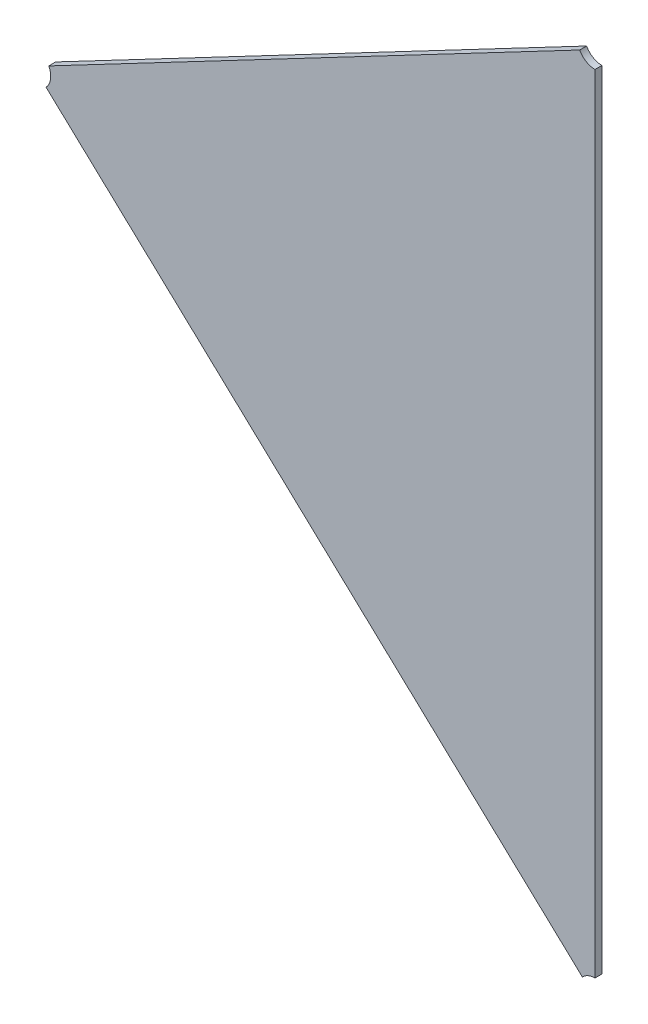
ISO-10303-21;
HEADER;
FILE_DESCRIPTION(('STEP AP214'),'2;1');
FILE_NAME('part.step','',(''),(''),'','','');
FILE_SCHEMA(('AUTOMOTIVE_DESIGN { 1 0 10303 214 1 1 1 1 }'));
ENDSEC;
DATA;
#1=APPLICATION_CONTEXT('core data for automotive mechanical design processes');
#2=APPLICATION_PROTOCOL_DEFINITION('international standard','automotive_design',2000,#1);
#3=PRODUCT_CONTEXT('',#1,'mechanical');
#4=PRODUCT('Part','Part','',(#3));
#5=PRODUCT_RELATED_PRODUCT_CATEGORY('part','',(#4));
#6=PRODUCT_DEFINITION_FORMATION('','',#4);
#7=PRODUCT_DEFINITION_CONTEXT('part definition',#1,'design');
#8=PRODUCT_DEFINITION('design','',#6,#7);
#9=PRODUCT_DEFINITION_SHAPE('','',#8);
#10=(LENGTH_UNIT() NAMED_UNIT(*) SI_UNIT(.MILLI.,.METRE.));
#11=(NAMED_UNIT(*) PLANE_ANGLE_UNIT() SI_UNIT($,.RADIAN.));
#12=(NAMED_UNIT(*) SI_UNIT($,.STERADIAN.) SOLID_ANGLE_UNIT());
#13=UNCERTAINTY_MEASURE_WITH_UNIT(LENGTH_MEASURE(1.E-05),#10,'distance_accuracy_value','');
#14=(GEOMETRIC_REPRESENTATION_CONTEXT(3) GLOBAL_UNCERTAINTY_ASSIGNED_CONTEXT((#13)) GLOBAL_UNIT_ASSIGNED_CONTEXT((#10,
#11,#12)) REPRESENTATION_CONTEXT('',''));
#15=CARTESIAN_POINT('',(0.,0.,0.));
#16=DIRECTION('',(0.,0.,1.));
#17=DIRECTION('',(1.,0.,0.));
#18=AXIS2_PLACEMENT_3D('',#15,#16,#17);
#19=CARTESIAN_POINT('',(-1.42761736866515,-0.918561701377886,0.));
#20=DIRECTION('',(0.,0.,1.));
#21=DIRECTION('',(1.,0.,0.));
#22=AXIS2_PLACEMENT_3D('',#19,#20,#21);
#23=PLANE('',#22);
#24=CARTESIAN_POINT('',(-1.37630287528467,-0.806521766430921,0.));
#25=DIRECTION('',(0.,0.,1.));
#26=DIRECTION('',(-0.885039467737435,-0.465515993868136,0.));
#27=AXIS2_PLACEMENT_3D('',#24,#25,#26);
#28=CIRCLE('',#27,0.00500000000000005);
#29=CARTESIAN_POINT('',(-1.38072807262335,-0.808849346400258,0.));
#30=VERTEX_POINT('',#29);
#31=CARTESIAN_POINT('',(-1.37630287528467,-0.811521766430921,0.));
#32=VERTEX_POINT('',#31);
#33=EDGE_CURVE('E11',#30,#32,#28,.T.);
#34=ORIENTED_EDGE('',*,*,#33,.T.);
#35=DIRECTION('',(0.,1.,0.));
#36=VECTOR('',#35,1.);
#37=CARTESIAN_POINT('',(-1.37630287528467,-1.03946386523316,0.));
#38=LINE('',#37,#36);
#39=CARTESIAN_POINT('',(-1.37630287528467,-1.03946386523316,0.));
#40=VERTEX_POINT('',#39);
#41=EDGE_CURVE('E116',#40,#32,#38,.T.);
#42=ORIENTED_EDGE('',*,*,#41,.F.);
#43=CARTESIAN_POINT('',(-1.37630287528467,-1.04446386523316,0.));
#44=DIRECTION('',(0.,0.,1.));
#45=DIRECTION('',(0.,1.,0.));
#46=AXIS2_PLACEMENT_3D('',#43,#44,#45);
#47=CIRCLE('',#46,0.00500000000000005);
#48=CARTESIAN_POINT('',(-1.37995198451857,-1.04104567831624,0.));
#49=VERTEX_POINT('',#48);
#50=EDGE_CURVE('E90',#40,#49,#47,.T.);
#51=ORIENTED_EDGE('',*,*,#50,.T.);
#52=DIRECTION('',(0.72982184678132,-0.683637383384425,0.));
#53=VECTOR('',#52,1.);
#54=CARTESIAN_POINT('',(-1.53532680727802,-0.895503258966166,0.));
#55=LINE('',#54,#53);
#56=CARTESIAN_POINT('',(-1.53532680727802,-0.895503258966164,0.));
#57=VERTEX_POINT('',#56);
#58=EDGE_CURVE('E103',#57,#49,#55,.T.);
#59=ORIENTED_EDGE('',*,*,#58,.F.);
#60=CARTESIAN_POINT('',(-1.53897591651193,-0.892085072049242,0.));
#61=DIRECTION('',(0.,0.,1.));
#62=DIRECTION('',(0.729821846781668,-0.683637383384054,0.));
#63=AXIS2_PLACEMENT_3D('',#60,#61,#62);
#64=CIRCLE('',#63,0.00500000000000004);
#65=CARTESIAN_POINT('',(-1.53455071917324,-0.889757492079906,0.));
#66=VERTEX_POINT('',#65);
#67=EDGE_CURVE('E77',#57,#66,#64,.T.);
#68=ORIENTED_EDGE('',*,*,#67,.T.);
#69=DIRECTION('',(-0.885039467737862,-0.465515993867324,0.));
#70=VECTOR('',#69,1.);
#71=CARTESIAN_POINT('',(-1.38072807262335,-0.808849346400254,0.));
#72=LINE('',#71,#70);
#73=EDGE_CURVE('E112',#30,#66,#72,.T.);
#74=ORIENTED_EDGE('',*,*,#73,.F.);
#75=EDGE_LOOP('',(#34,#42,#51,#59,#68,#74));
#76=FACE_BOUND('',#75,.T.);
#77=ADVANCED_FACE('F17',(#76),#23,.F.);
#78=CARTESIAN_POINT('',(-1.37630287528467,-0.806521766430921,0.));
#79=DIRECTION('',(-0.465515993867324,0.885039467737862,0.));
#80=DIRECTION('',(-0.885039467737862,-0.465515993867324,0.));
#81=AXIS2_PLACEMENT_3D('',#78,#79,#80);
#82=PLANE('',#81);
#83=DIRECTION('',(0.,0.,-1.));
#84=VECTOR('',#83,1.);
#85=CARTESIAN_POINT('',(-1.38072807262335,-0.808849346400258,0.002));
#86=LINE('',#85,#84);
#87=CARTESIAN_POINT('',(-1.38072807262335,-0.808849346400258,0.002));
#88=VERTEX_POINT('',#87);
#89=EDGE_CURVE('E24',#88,#30,#86,.T.);
#90=ORIENTED_EDGE('',*,*,#89,.T.);
#91=ORIENTED_EDGE('',*,*,#73,.T.);
#92=DIRECTION('',(0.,0.,1.));
#93=VECTOR('',#92,1.);
#94=CARTESIAN_POINT('',(-1.53455071917324,-0.889757492079906,0.));
#95=LINE('',#94,#93);
#96=CARTESIAN_POINT('',(-1.53455071917324,-0.889757492079906,0.002));
#97=VERTEX_POINT('',#96);
#98=EDGE_CURVE('E106',#66,#97,#95,.T.);
#99=ORIENTED_EDGE('',*,*,#98,.T.);
#100=DIRECTION('',(-0.885039467737862,-0.465515993867324,0.));
#101=VECTOR('',#100,1.);
#102=CARTESIAN_POINT('',(-1.38072807262335,-0.808849346400254,0.002));
#103=LINE('',#102,#101);
#104=EDGE_CURVE('E99',#88,#97,#103,.T.);
#105=ORIENTED_EDGE('',*,*,#104,.F.);
#106=EDGE_LOOP('',(#90,#91,#99,#105));
#107=FACE_BOUND('',#106,.T.);
#108=ADVANCED_FACE('F120',(#107),#82,.T.);
#109=CARTESIAN_POINT('',(-1.53897591651193,-0.892085072049242,0.));
#110=DIRECTION('',(-0.683637383384425,-0.729821846781321,0.));
#111=DIRECTION('',(0.729821846781321,-0.683637383384425,0.));
#112=AXIS2_PLACEMENT_3D('',#109,#110,#111);
#113=PLANE('',#112);
#114=DIRECTION('',(0.,0.,1.));
#115=VECTOR('',#114,1.);
#116=CARTESIAN_POINT('',(-1.37995198451857,-1.04104567831624,0.));
#117=LINE('',#116,#115);
#118=CARTESIAN_POINT('',(-1.37995198451857,-1.04104567831624,0.002));
#119=VERTEX_POINT('',#118);
#120=EDGE_CURVE('E114',#49,#119,#117,.T.);
#121=ORIENTED_EDGE('',*,*,#120,.T.);
#122=DIRECTION('',(0.72982184678132,-0.683637383384425,0.));
#123=VECTOR('',#122,1.);
#124=CARTESIAN_POINT('',(-1.53532680727802,-0.895503258966166,0.002));
#125=LINE('',#124,#123);
#126=CARTESIAN_POINT('',(-1.53532680727802,-0.895503258966164,0.002));
#127=VERTEX_POINT('',#126);
#128=EDGE_CURVE('E85',#127,#119,#125,.T.);
#129=ORIENTED_EDGE('',*,*,#128,.F.);
#130=DIRECTION('',(0.,0.,-1.));
#131=VECTOR('',#130,1.);
#132=CARTESIAN_POINT('',(-1.53532680727802,-0.895503258966164,0.002));
#133=LINE('',#132,#131);
#134=EDGE_CURVE('E96',#127,#57,#133,.T.);
#135=ORIENTED_EDGE('',*,*,#134,.T.);
#136=ORIENTED_EDGE('',*,*,#58,.T.);
#137=EDGE_LOOP('',(#121,#129,#135,#136));
#138=FACE_BOUND('',#137,.T.);
#139=ADVANCED_FACE('F127',(#138),#113,.T.);
#140=CARTESIAN_POINT('',(-1.42761736866515,-0.918561701377886,0.002));
#141=DIRECTION('',(0.,0.,1.));
#142=DIRECTION('',(1.,0.,0.));
#143=AXIS2_PLACEMENT_3D('',#140,#141,#142);
#144=PLANE('',#143);
#145=CARTESIAN_POINT('',(-1.37630287528467,-0.806521766430921,0.002));
#146=DIRECTION('',(0.,0.,-1.));
#147=DIRECTION('',(0.,-1.,0.));
#148=AXIS2_PLACEMENT_3D('',#145,#146,#147);
#149=CIRCLE('',#148,0.00500000000000005);
#150=CARTESIAN_POINT('',(-1.37630287528467,-0.811521766430921,0.002));
#151=VERTEX_POINT('',#150);
#152=EDGE_CURVE('E109',#151,#88,#149,.T.);
#153=ORIENTED_EDGE('',*,*,#152,.T.);
#154=ORIENTED_EDGE('',*,*,#104,.T.);
#155=CARTESIAN_POINT('',(-1.53897591651193,-0.892085072049242,0.002));
#156=DIRECTION('',(0.,0.,-1.));
#157=DIRECTION('',(0.885039467737943,0.465515993867169,0.));
#158=AXIS2_PLACEMENT_3D('',#155,#156,#157);
#159=CIRCLE('',#158,0.00500000000000004);
#160=EDGE_CURVE('E78',#97,#127,#159,.T.);
#161=ORIENTED_EDGE('',*,*,#160,.T.);
#162=ORIENTED_EDGE('',*,*,#128,.T.);
#163=CARTESIAN_POINT('',(-1.37630287528467,-1.04446386523316,0.002));
#164=DIRECTION('',(0.,0.,-1.));
#165=DIRECTION('',(-0.729821846780916,0.683637383384856,0.));
#166=AXIS2_PLACEMENT_3D('',#163,#164,#165);
#167=CIRCLE('',#166,0.00500000000000005);
#168=CARTESIAN_POINT('',(-1.37630287528467,-1.03946386523316,0.002));
#169=VERTEX_POINT('',#168);
#170=EDGE_CURVE('E82',#119,#169,#167,.T.);
#171=ORIENTED_EDGE('',*,*,#170,.T.);
#172=DIRECTION('',(0.,1.,0.));
#173=VECTOR('',#172,1.);
#174=CARTESIAN_POINT('',(-1.37630287528467,-1.03946386523316,0.002));
#175=LINE('',#174,#173);
#176=EDGE_CURVE('E67',#169,#151,#175,.T.);
#177=ORIENTED_EDGE('',*,*,#176,.T.);
#178=EDGE_LOOP('',(#153,#154,#161,#162,#171,#177));
#179=FACE_BOUND('',#178,.T.);
#180=ADVANCED_FACE('F83',(#179),#144,.T.);
#181=CARTESIAN_POINT('',(-1.37630287528467,-1.04446386523316,0.));
#182=DIRECTION('',(1.,0.,0.));
#183=DIRECTION('',(0.,1.,0.));
#184=AXIS2_PLACEMENT_3D('',#181,#182,#183);
#185=PLANE('',#184);
#186=DIRECTION('',(0.,0.,1.));
#187=VECTOR('',#186,1.);
#188=CARTESIAN_POINT('',(-1.37630287528467,-0.811521766430921,0.));
#189=LINE('',#188,#187);
#190=EDGE_CURVE('E74',#32,#151,#189,.T.);
#191=ORIENTED_EDGE('',*,*,#190,.T.);
#192=ORIENTED_EDGE('',*,*,#176,.F.);
#193=DIRECTION('',(0.,0.,-1.));
#194=VECTOR('',#193,1.);
#195=CARTESIAN_POINT('',(-1.37630287528467,-1.03946386523316,0.002));
#196=LINE('',#195,#194);
#197=EDGE_CURVE('E71',#169,#40,#196,.T.);
#198=ORIENTED_EDGE('',*,*,#197,.T.);
#199=ORIENTED_EDGE('',*,*,#41,.T.);
#200=EDGE_LOOP('',(#191,#192,#198,#199));
#201=FACE_BOUND('',#200,.T.);
#202=ADVANCED_FACE('F69',(#201),#185,.T.);
#203=CARTESIAN_POINT('',(-1.53897591651193,-0.892085072049242,0.002));
#204=DIRECTION('',(0.,0.,1.));
#205=DIRECTION('',(0.991000826132315,-0.133855752977113,0.));
#206=AXIS2_PLACEMENT_3D('',#203,#204,#205);
#207=CYLINDRICAL_SURFACE('',#206,0.00500000000000004);
#208=ORIENTED_EDGE('',*,*,#98,.F.);
#209=ORIENTED_EDGE('',*,*,#67,.F.);
#210=ORIENTED_EDGE('',*,*,#134,.F.);
#211=ORIENTED_EDGE('',*,*,#160,.F.);
#212=EDGE_LOOP('',(#208,#209,#210,#211));
#213=FACE_BOUND('',#212,.T.);
#214=ADVANCED_FACE('F124',(#213),#207,.F.);
#215=CARTESIAN_POINT('',(-1.37630287528467,-1.04446386523316,0.002));
#216=DIRECTION('',(0.,0.,1.));
#217=DIRECTION('',(-1.,0.,0.));
#218=AXIS2_PLACEMENT_3D('',#215,#216,#217);
#219=CYLINDRICAL_SURFACE('',#218,0.00500000000000005);
#220=ORIENTED_EDGE('',*,*,#120,.F.);
#221=ORIENTED_EDGE('',*,*,#50,.F.);
#222=ORIENTED_EDGE('',*,*,#197,.F.);
#223=ORIENTED_EDGE('',*,*,#170,.F.);
#224=EDGE_LOOP('',(#220,#221,#222,#223));
#225=FACE_BOUND('',#224,.T.);
#226=ADVANCED_FACE('F89',(#225),#219,.F.);
#227=CARTESIAN_POINT('',(-1.37630287528467,-0.806521766430921,0.002));
#228=DIRECTION('',(0.,0.,1.));
#229=DIRECTION('',(-1.,0.,0.));
#230=AXIS2_PLACEMENT_3D('',#227,#228,#229);
#231=CYLINDRICAL_SURFACE('',#230,0.00500000000000005);
#232=ORIENTED_EDGE('',*,*,#89,.F.);
#233=ORIENTED_EDGE('',*,*,#152,.F.);
#234=ORIENTED_EDGE('',*,*,#190,.F.);
#235=ORIENTED_EDGE('',*,*,#33,.F.);
#236=EDGE_LOOP('',(#232,#233,#234,#235));
#237=FACE_BOUND('',#236,.T.);
#238=ADVANCED_FACE('F118',(#237),#231,.F.);
#239=CLOSED_SHELL('',(#77,#108,#139,#180,#202,#214,#226,#238));
#240=MANIFOLD_SOLID_BREP('B1',#239);
#241=ADVANCED_BREP_SHAPE_REPRESENTATION('',(#18,#240),#14);
#242=SHAPE_DEFINITION_REPRESENTATION(#9,#241);
ENDSEC;
END-ISO-10303-21;
